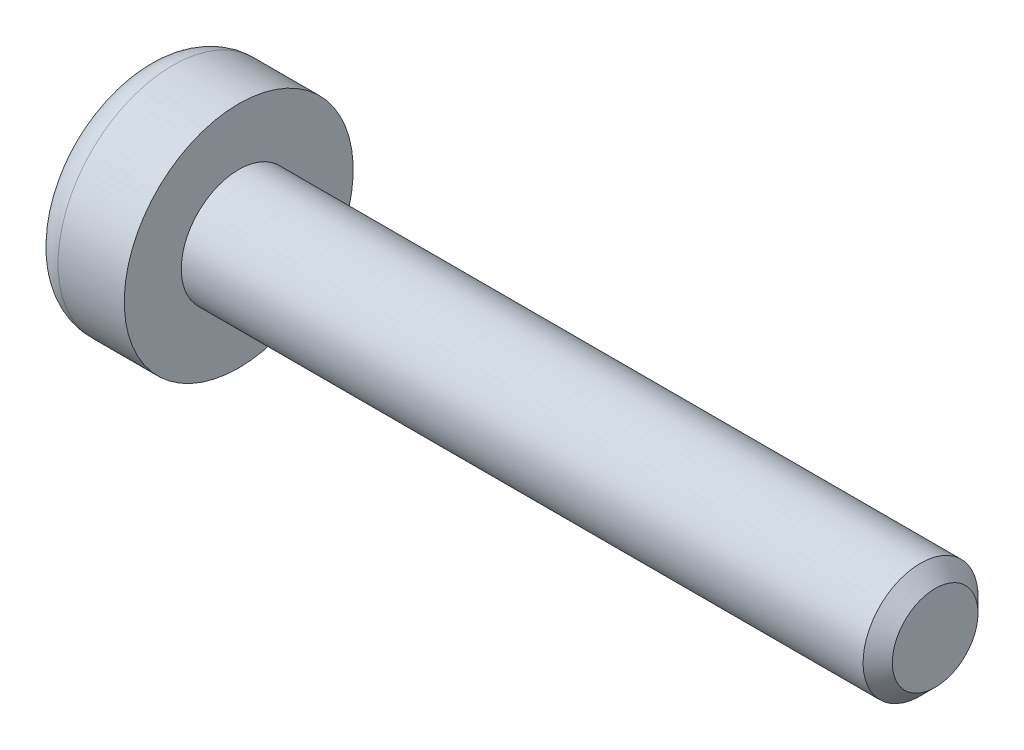
ISO-10303-21;
HEADER;
FILE_DESCRIPTION(('STEP AP214'),'2;1');
FILE_NAME('part.step','',(''),(''),'','','');
FILE_SCHEMA(('AUTOMOTIVE_DESIGN { 1 0 10303 214 1 1 1 1 }'));
ENDSEC;
DATA;
#1=APPLICATION_CONTEXT('core data for automotive mechanical design processes');
#2=APPLICATION_PROTOCOL_DEFINITION('international standard','automotive_design',2000,#1);
#3=PRODUCT_CONTEXT('',#1,'mechanical');
#4=PRODUCT('Part','Part','',(#3));
#5=PRODUCT_RELATED_PRODUCT_CATEGORY('part','',(#4));
#6=PRODUCT_DEFINITION_FORMATION('','',#4);
#7=PRODUCT_DEFINITION_CONTEXT('part definition',#1,'design');
#8=PRODUCT_DEFINITION('design','',#6,#7);
#9=PRODUCT_DEFINITION_SHAPE('','',#8);
#10=(LENGTH_UNIT() NAMED_UNIT(*) SI_UNIT(.MILLI.,.METRE.));
#11=(NAMED_UNIT(*) PLANE_ANGLE_UNIT() SI_UNIT($,.RADIAN.));
#12=(NAMED_UNIT(*) SI_UNIT($,.STERADIAN.) SOLID_ANGLE_UNIT());
#13=UNCERTAINTY_MEASURE_WITH_UNIT(LENGTH_MEASURE(1.E-05),#10,'distance_accuracy_value','');
#14=(GEOMETRIC_REPRESENTATION_CONTEXT(3) GLOBAL_UNCERTAINTY_ASSIGNED_CONTEXT((#13)) GLOBAL_UNIT_ASSIGNED_CONTEXT((#10,
#11,#12)) REPRESENTATION_CONTEXT('',''));
#15=CARTESIAN_POINT('',(0.,0.,0.));
#16=DIRECTION('',(0.,0.,1.));
#17=DIRECTION('',(1.,0.,0.));
#18=AXIS2_PLACEMENT_3D('',#15,#16,#17);
#19=CARTESIAN_POINT('',(0.,0.,0.));
#20=DIRECTION('',(1.,0.,0.));
#21=DIRECTION('',(0.,1.,0.));
#22=AXIS2_PLACEMENT_3D('',#19,#20,#21);
#23=PLANE('',#22);
#24=CARTESIAN_POINT('',(0.,0.,0.));
#25=DIRECTION('',(1.,0.,0.));
#26=DIRECTION('',(0.,1.,0.));
#27=AXIS2_PLACEMENT_3D('',#24,#25,#26);
#28=CIRCLE('',#27,1.1176);
#29=CARTESIAN_POINT('',(0.,1.1176,0.));
#30=VERTEX_POINT('',#29);
#31=EDGE_CURVE('E190',#30,#30,#28,.T.);
#32=ORIENTED_EDGE('',*,*,#31,.T.);
#33=EDGE_LOOP('',(#32));
#34=FACE_BOUND('',#33,.T.);
#35=ADVANCED_FACE('F36',(#34),#23,.T.);
#36=CARTESIAN_POINT('',(0.,0.,0.));
#37=DIRECTION('',(-1.,0.,0.));
#38=DIRECTION('',(0.,-1.,0.));
#39=AXIS2_PLACEMENT_3D('',#36,#37,#38);
#40=CONICAL_SURFACE('',#39,1.1176,0.785398163397448);
#41=CARTESIAN_POINT('',(-0.381,0.,0.));
#42=DIRECTION('',(1.,0.,0.));
#43=DIRECTION('',(0.,1.,0.));
#44=AXIS2_PLACEMENT_3D('',#41,#42,#43);
#45=CIRCLE('',#44,1.4986);
#46=CARTESIAN_POINT('',(-0.381,1.4986,0.));
#47=VERTEX_POINT('',#46);
#48=EDGE_CURVE('E187',#47,#47,#45,.T.);
#49=ORIENTED_EDGE('',*,*,#48,.T.);
#50=EDGE_LOOP('',(#49));
#51=FACE_BOUND('',#50,.T.);
#52=ORIENTED_EDGE('',*,*,#31,.F.);
#53=EDGE_LOOP('',(#52));
#54=FACE_BOUND('',#53,.T.);
#55=ADVANCED_FACE('F210',(#51,#54),#40,.T.);
#56=CARTESIAN_POINT('',(0.,0.,0.));
#57=DIRECTION('',(1.,0.,0.));
#58=DIRECTION('',(0.,1.,0.));
#59=AXIS2_PLACEMENT_3D('',#56,#57,#58);
#60=CYLINDRICAL_SURFACE('',#59,1.4986);
#61=CARTESIAN_POINT('',(-18.161,0.,0.));
#62=DIRECTION('',(1.,0.,0.));
#63=DIRECTION('',(0.,1.,0.));
#64=AXIS2_PLACEMENT_3D('',#61,#62,#63);
#65=CIRCLE('',#64,1.4986);
#66=CARTESIAN_POINT('',(-18.161,1.4986,0.));
#67=VERTEX_POINT('',#66);
#68=EDGE_CURVE('E184',#67,#67,#65,.T.);
#69=ORIENTED_EDGE('',*,*,#68,.T.);
#70=EDGE_LOOP('',(#69));
#71=FACE_BOUND('',#70,.T.);
#72=ORIENTED_EDGE('',*,*,#48,.F.);
#73=EDGE_LOOP('',(#72));
#74=FACE_BOUND('',#73,.T.);
#75=ADVANCED_FACE('F215',(#71,#74),#60,.T.);
#76=CARTESIAN_POINT('',(-18.161,2.9845,0.));
#77=DIRECTION('',(1.,0.,0.));
#78=DIRECTION('',(0.,1.,0.));
#79=AXIS2_PLACEMENT_3D('',#76,#77,#78);
#80=PLANE('',#79);
#81=CARTESIAN_POINT('',(-18.161,0.,0.));
#82=DIRECTION('',(1.,0.,0.));
#83=DIRECTION('',(0.,1.,0.));
#84=AXIS2_PLACEMENT_3D('',#81,#82,#83);
#85=CIRCLE('',#84,2.9845);
#86=CARTESIAN_POINT('',(-18.161,2.9845,0.));
#87=VERTEX_POINT('',#86);
#88=EDGE_CURVE('E181',#87,#87,#85,.T.);
#89=ORIENTED_EDGE('',*,*,#88,.T.);
#90=EDGE_LOOP('',(#89));
#91=FACE_BOUND('',#90,.T.);
#92=ORIENTED_EDGE('',*,*,#68,.F.);
#93=EDGE_LOOP('',(#92));
#94=FACE_BOUND('',#93,.T.);
#95=ADVANCED_FACE('F221',(#91,#94),#80,.T.);
#96=CARTESIAN_POINT('',(0.,0.,0.));
#97=DIRECTION('',(1.,0.,0.));
#98=DIRECTION('',(0.,1.,0.));
#99=AXIS2_PLACEMENT_3D('',#96,#97,#98);
#100=CYLINDRICAL_SURFACE('',#99,2.9845);
#101=CARTESIAN_POINT('',(-19.8882,0.,0.));
#102=DIRECTION('',(-1.,0.,0.));
#103=DIRECTION('',(0.,-1.,0.));
#104=AXIS2_PLACEMENT_3D('',#101,#102,#103);
#105=CIRCLE('',#104,2.9845);
#106=CARTESIAN_POINT('',(-19.8882,-2.9845,0.));
#107=VERTEX_POINT('',#106);
#108=EDGE_CURVE('E44',#107,#107,#105,.F.);
#109=ORIENTED_EDGE('',*,*,#108,.T.);
#110=EDGE_LOOP('',(#109));
#111=FACE_BOUND('',#110,.T.);
#112=ORIENTED_EDGE('',*,*,#88,.F.);
#113=EDGE_LOOP('',(#112));
#114=FACE_BOUND('',#113,.T.);
#115=ADVANCED_FACE('F195',(#111,#114),#100,.T.);
#116=CARTESIAN_POINT('',(-20.6502,0.,0.));
#117=DIRECTION('',(-1.,0.,0.));
#118=DIRECTION('',(0.,-1.,0.));
#119=AXIS2_PLACEMENT_3D('',#116,#117,#118);
#120=PLANE('',#119);
#121=DIRECTION('',(0.,0.,-1.));
#122=VECTOR('',#121,1.);
#123=CARTESIAN_POINT('',(-20.6502,0.380999999999998,-0.381));
#124=LINE('',#123,#122);
#125=CARTESIAN_POINT('',(-20.6502,0.380999999999998,-0.381));
#126=VERTEX_POINT('',#125);
#127=CARTESIAN_POINT('',(-20.6502,0.380999999999997,-1.905));
#128=VERTEX_POINT('',#127);
#129=EDGE_CURVE('E51',#126,#128,#124,.T.);
#130=ORIENTED_EDGE('',*,*,#129,.F.);
#131=DIRECTION('',(0.,-1.,0.));
#132=VECTOR('',#131,1.);
#133=CARTESIAN_POINT('',(-20.6502,1.905,-0.381));
#134=LINE('',#133,#132);
#135=CARTESIAN_POINT('',(-20.6502,1.905,-0.381));
#136=VERTEX_POINT('',#135);
#137=EDGE_CURVE('E149',#136,#126,#134,.T.);
#138=ORIENTED_EDGE('',*,*,#137,.F.);
#139=DIRECTION('',(0.,0.,-1.));
#140=VECTOR('',#139,1.);
#141=CARTESIAN_POINT('',(-20.6502,1.905,0.381));
#142=LINE('',#141,#140);
#143=CARTESIAN_POINT('',(-20.6502,1.905,0.381));
#144=VERTEX_POINT('',#143);
#145=EDGE_CURVE('E146',#144,#136,#142,.T.);
#146=ORIENTED_EDGE('',*,*,#145,.F.);
#147=DIRECTION('',(0.,1.,0.));
#148=VECTOR('',#147,1.);
#149=CARTESIAN_POINT('',(-20.6502,1.905,0.381));
#150=LINE('',#149,#148);
#151=CARTESIAN_POINT('',(-20.6502,0.380999999999998,0.381));
#152=VERTEX_POINT('',#151);
#153=EDGE_CURVE('E143',#152,#144,#150,.T.);
#154=ORIENTED_EDGE('',*,*,#153,.F.);
#155=DIRECTION('',(0.,0.,-1.));
#156=VECTOR('',#155,1.);
#157=CARTESIAN_POINT('',(-20.6502,0.380999999999998,1.905));
#158=LINE('',#157,#156);
#159=CARTESIAN_POINT('',(-20.6502,0.380999999999998,1.905));
#160=VERTEX_POINT('',#159);
#161=EDGE_CURVE('E140',#160,#152,#158,.T.);
#162=ORIENTED_EDGE('',*,*,#161,.F.);
#163=DIRECTION('',(0.,1.,0.));
#164=VECTOR('',#163,1.);
#165=CARTESIAN_POINT('',(-20.6502,-0.381000000000002,1.905));
#166=LINE('',#165,#164);
#167=CARTESIAN_POINT('',(-20.6502,-0.381000000000002,1.905));
#168=VERTEX_POINT('',#167);
#169=EDGE_CURVE('E137',#168,#160,#166,.T.);
#170=ORIENTED_EDGE('',*,*,#169,.F.);
#171=DIRECTION('',(0.,0.,1.));
#172=VECTOR('',#171,1.);
#173=CARTESIAN_POINT('',(-20.6502,-0.381000000000002,1.905));
#174=LINE('',#173,#172);
#175=CARTESIAN_POINT('',(-20.6502,-0.381000000000002,0.381));
#176=VERTEX_POINT('',#175);
#177=EDGE_CURVE('E134',#176,#168,#174,.T.);
#178=ORIENTED_EDGE('',*,*,#177,.F.);
#179=DIRECTION('',(0.,1.,0.));
#180=VECTOR('',#179,1.);
#181=CARTESIAN_POINT('',(-20.6502,-0.381000000000002,0.381));
#182=LINE('',#181,#180);
#183=CARTESIAN_POINT('',(-20.6502,-1.905,0.381));
#184=VERTEX_POINT('',#183);
#185=EDGE_CURVE('E131',#184,#176,#182,.T.);
#186=ORIENTED_EDGE('',*,*,#185,.F.);
#187=DIRECTION('',(0.,0.,1.));
#188=VECTOR('',#187,1.);
#189=CARTESIAN_POINT('',(-20.6502,-1.905,0.381));
#190=LINE('',#189,#188);
#191=CARTESIAN_POINT('',(-20.6502,-1.905,-0.381));
#192=VERTEX_POINT('',#191);
#193=EDGE_CURVE('E125',#192,#184,#190,.T.);
#194=ORIENTED_EDGE('',*,*,#193,.F.);
#195=DIRECTION('',(0.,-1.,0.));
#196=VECTOR('',#195,1.);
#197=CARTESIAN_POINT('',(-20.6502,-0.381000000000003,-0.381));
#198=LINE('',#197,#196);
#199=CARTESIAN_POINT('',(-20.6502,-0.381000000000003,-0.381));
#200=VERTEX_POINT('',#199);
#201=EDGE_CURVE('E123',#200,#192,#198,.T.);
#202=ORIENTED_EDGE('',*,*,#201,.F.);
#203=DIRECTION('',(0.,0.,1.));
#204=VECTOR('',#203,1.);
#205=CARTESIAN_POINT('',(-20.6502,-0.381000000000003,-0.381));
#206=LINE('',#205,#204);
#207=CARTESIAN_POINT('',(-20.6502,-0.381000000000003,-1.905));
#208=VERTEX_POINT('',#207);
#209=EDGE_CURVE('E108',#208,#200,#206,.T.);
#210=ORIENTED_EDGE('',*,*,#209,.F.);
#211=DIRECTION('',(0.,-1.,0.));
#212=VECTOR('',#211,1.);
#213=CARTESIAN_POINT('',(-20.6502,-0.381000000000003,-1.905));
#214=LINE('',#213,#212);
#215=EDGE_CURVE('E115',#128,#208,#214,.T.);
#216=ORIENTED_EDGE('',*,*,#215,.F.);
#217=EDGE_LOOP('',(#130,#138,#146,#154,#162,#170,#178,#186,#194,#202,#210,#216));
#218=FACE_BOUND('',#217,.T.);
#219=CARTESIAN_POINT('',(-20.6502,0.,0.));
#220=DIRECTION('',(-1.,0.,0.));
#221=DIRECTION('',(0.,-1.,0.));
#222=AXIS2_PLACEMENT_3D('',#219,#220,#221);
#223=CIRCLE('',#222,2.2225);
#224=CARTESIAN_POINT('',(-20.6502,-2.2225,0.));
#225=VERTEX_POINT('',#224);
#226=EDGE_CURVE('E11',#225,#225,#223,.T.);
#227=ORIENTED_EDGE('',*,*,#226,.T.);
#228=EDGE_LOOP('',(#227));
#229=FACE_BOUND('',#228,.T.);
#230=ADVANCED_FACE('F119',(#218,#229),#120,.T.);
#231=CARTESIAN_POINT('',(-19.8882,0.,0.));
#232=DIRECTION('',(-1.,0.,0.));
#233=DIRECTION('',(0.,-1.,0.));
#234=AXIS2_PLACEMENT_3D('',#231,#232,#233);
#235=TOROIDAL_SURFACE('',#234,2.2225,0.762);
#236=ORIENTED_EDGE('',*,*,#226,.F.);
#237=EDGE_LOOP('',(#236));
#238=FACE_BOUND('',#237,.T.);
#239=ORIENTED_EDGE('',*,*,#108,.F.);
#240=EDGE_LOOP('',(#239));
#241=FACE_BOUND('',#240,.T.);
#242=ADVANCED_FACE('F38',(#238,#241),#235,.T.);
#243=CARTESIAN_POINT('',(-20.6502,0.380999999999998,-0.381));
#244=DIRECTION('',(0.707106781186549,0.707106781186546,0.));
#245=DIRECTION('',(-0.707106781186546,0.707106781186549,0.));
#246=AXIS2_PLACEMENT_3D('',#243,#244,#245);
#247=PLANE('',#246);
#248=DIRECTION('',(0.,0.,1.));
#249=VECTOR('',#248,1.);
#250=CARTESIAN_POINT('',(-20.2692,0.,-0.381));
#251=LINE('',#250,#249);
#252=CARTESIAN_POINT('',(-20.2692,0.,-1.524));
#253=VERTEX_POINT('',#252);
#254=CARTESIAN_POINT('',(-20.2692,0.,0.));
#255=VERTEX_POINT('',#254);
#256=EDGE_CURVE('E56',#253,#255,#251,.T.);
#257=ORIENTED_EDGE('',*,*,#256,.T.);
#258=DIRECTION('',(-0.577350269189624,0.577350269189626,-0.577350269189627));
#259=VECTOR('',#258,1.);
#260=CARTESIAN_POINT('',(-20.6502,0.380999999999998,-0.381));
#261=LINE('',#260,#259);
#262=EDGE_CURVE('E152',#255,#126,#261,.T.);
#263=ORIENTED_EDGE('',*,*,#262,.T.);
#264=ORIENTED_EDGE('',*,*,#129,.T.);
#265=DIRECTION('',(-0.577350269189625,0.577350269189626,-0.577350269189627));
#266=VECTOR('',#265,1.);
#267=CARTESIAN_POINT('',(-20.1422,-0.127000000000004,-1.397));
#268=LINE('',#267,#266);
#269=EDGE_CURVE('E112',#253,#128,#268,.T.);
#270=ORIENTED_EDGE('',*,*,#269,.F.);
#271=EDGE_LOOP('',(#257,#263,#264,#270));
#272=FACE_BOUND('',#271,.T.);
#273=ADVANCED_FACE('F199',(#272),#247,.F.);
#274=CARTESIAN_POINT('',(-20.6502,1.905,-0.381));
#275=DIRECTION('',(0.707106781186549,0.,-0.707106781186546));
#276=DIRECTION('',(-0.707106781186546,0.,-0.707106781186549));
#277=AXIS2_PLACEMENT_3D('',#274,#275,#276);
#278=PLANE('',#277);
#279=DIRECTION('',(-0.577350269189624,0.577350269189626,-0.577350269189627));
#280=VECTOR('',#279,1.);
#281=CARTESIAN_POINT('',(-20.3962,1.651,-0.126999999999999));
#282=LINE('',#281,#280);
#283=CARTESIAN_POINT('',(-20.2692,1.524,0.));
#284=VERTEX_POINT('',#283);
#285=EDGE_CURVE('E155',#284,#136,#282,.T.);
#286=ORIENTED_EDGE('',*,*,#285,.T.);
#287=ORIENTED_EDGE('',*,*,#137,.T.);
#288=ORIENTED_EDGE('',*,*,#262,.F.);
#289=DIRECTION('',(0.,-1.,0.));
#290=VECTOR('',#289,1.);
#291=CARTESIAN_POINT('',(-20.2692,1.905,0.));
#292=LINE('',#291,#290);
#293=EDGE_CURVE('E154',#284,#255,#292,.T.);
#294=ORIENTED_EDGE('',*,*,#293,.F.);
#295=EDGE_LOOP('',(#286,#287,#288,#294));
#296=FACE_BOUND('',#295,.T.);
#297=ADVANCED_FACE('F205',(#296),#278,.F.);
#298=CARTESIAN_POINT('',(-20.6502,1.905,0.381));
#299=DIRECTION('',(0.707106781186549,0.707106781186546,0.));
#300=DIRECTION('',(-0.707106781186546,0.707106781186549,0.));
#301=AXIS2_PLACEMENT_3D('',#298,#299,#300);
#302=PLANE('',#301);
#303=ORIENTED_EDGE('',*,*,#145,.T.);
#304=ORIENTED_EDGE('',*,*,#285,.F.);
#305=DIRECTION('',(-0.577350269189624,0.577350269189626,0.577350269189626));
#306=VECTOR('',#305,1.);
#307=CARTESIAN_POINT('',(-20.6502,1.905,0.381));
#308=LINE('',#307,#306);
#309=EDGE_CURVE('E170',#284,#144,#308,.T.);
#310=ORIENTED_EDGE('',*,*,#309,.T.);
#311=EDGE_LOOP('',(#303,#304,#310));
#312=FACE_BOUND('',#311,.T.);
#313=ADVANCED_FACE('F230',(#312),#302,.F.);
#314=CARTESIAN_POINT('',(-20.6502,1.905,0.381));
#315=DIRECTION('',(0.707106781186549,0.,0.707106781186546));
#316=DIRECTION('',(0.707106781186546,0.,-0.707106781186549));
#317=AXIS2_PLACEMENT_3D('',#314,#315,#316);
#318=PLANE('',#317);
#319=ORIENTED_EDGE('',*,*,#293,.T.);
#320=DIRECTION('',(-0.577350269189625,0.577350269189627,0.577350269189627));
#321=VECTOR('',#320,1.);
#322=CARTESIAN_POINT('',(-21.1582,0.888999999999999,0.889000000000001));
#323=LINE('',#322,#321);
#324=EDGE_CURVE('E168',#255,#152,#323,.T.);
#325=ORIENTED_EDGE('',*,*,#324,.T.);
#326=ORIENTED_EDGE('',*,*,#153,.T.);
#327=ORIENTED_EDGE('',*,*,#309,.F.);
#328=EDGE_LOOP('',(#319,#325,#326,#327));
#329=FACE_BOUND('',#328,.T.);
#330=ADVANCED_FACE('F234',(#329),#318,.F.);
#331=CARTESIAN_POINT('',(-20.6502,0.380999999999998,1.905));
#332=DIRECTION('',(0.707106781186549,0.707106781186546,0.));
#333=DIRECTION('',(-0.707106781186546,0.707106781186549,0.));
#334=AXIS2_PLACEMENT_3D('',#331,#332,#333);
#335=PLANE('',#334);
#336=DIRECTION('',(-0.577350269189624,0.577350269189626,0.577350269189627));
#337=VECTOR('',#336,1.);
#338=CARTESIAN_POINT('',(-20.3962,0.126999999999997,1.651));
#339=LINE('',#338,#337);
#340=CARTESIAN_POINT('',(-20.2692,0.,1.524));
#341=VERTEX_POINT('',#340);
#342=EDGE_CURVE('E166',#341,#160,#339,.T.);
#343=ORIENTED_EDGE('',*,*,#342,.T.);
#344=ORIENTED_EDGE('',*,*,#161,.T.);
#345=ORIENTED_EDGE('',*,*,#324,.F.);
#346=DIRECTION('',(0.,0.,-1.));
#347=VECTOR('',#346,1.);
#348=CARTESIAN_POINT('',(-20.2692,0.,1.905));
#349=LINE('',#348,#347);
#350=EDGE_CURVE('E175',#341,#255,#349,.T.);
#351=ORIENTED_EDGE('',*,*,#350,.F.);
#352=EDGE_LOOP('',(#343,#344,#345,#351));
#353=FACE_BOUND('',#352,.T.);
#354=ADVANCED_FACE('F238',(#353),#335,.F.);
#355=CARTESIAN_POINT('',(-20.6502,-0.381000000000002,1.905));
#356=DIRECTION('',(0.707106781186549,0.,0.707106781186546));
#357=DIRECTION('',(0.707106781186546,0.,-0.707106781186549));
#358=AXIS2_PLACEMENT_3D('',#355,#356,#357);
#359=PLANE('',#358);
#360=ORIENTED_EDGE('',*,*,#169,.T.);
#361=ORIENTED_EDGE('',*,*,#342,.F.);
#362=DIRECTION('',(-0.577350269189624,-0.577350269189627,0.577350269189626));
#363=VECTOR('',#362,1.);
#364=CARTESIAN_POINT('',(-20.6502,-0.381000000000002,1.905));
#365=LINE('',#364,#363);
#366=EDGE_CURVE('E164',#341,#168,#365,.T.);
#367=ORIENTED_EDGE('',*,*,#366,.T.);
#368=EDGE_LOOP('',(#360,#361,#367));
#369=FACE_BOUND('',#368,.T.);
#370=ADVANCED_FACE('F242',(#369),#359,.F.);
#371=CARTESIAN_POINT('',(-20.6502,-0.381000000000002,1.905));
#372=DIRECTION('',(0.707106781186549,-0.707106781186546,0.));
#373=DIRECTION('',(0.707106781186546,0.707106781186549,0.));
#374=AXIS2_PLACEMENT_3D('',#371,#372,#373);
#375=PLANE('',#374);
#376=ORIENTED_EDGE('',*,*,#350,.T.);
#377=DIRECTION('',(-0.577350269189624,-0.577350269189627,0.577350269189627));
#378=VECTOR('',#377,1.);
#379=CARTESIAN_POINT('',(-21.1582,-0.889000000000003,0.889000000000002));
#380=LINE('',#379,#378);
#381=EDGE_CURVE('E162',#255,#176,#380,.T.);
#382=ORIENTED_EDGE('',*,*,#381,.T.);
#383=ORIENTED_EDGE('',*,*,#177,.T.);
#384=ORIENTED_EDGE('',*,*,#366,.F.);
#385=EDGE_LOOP('',(#376,#382,#383,#384));
#386=FACE_BOUND('',#385,.T.);
#387=ADVANCED_FACE('F246',(#386),#375,.F.);
#388=CARTESIAN_POINT('',(-20.6502,-0.381000000000002,0.381));
#389=DIRECTION('',(0.707106781186549,0.,0.707106781186546));
#390=DIRECTION('',(0.707106781186546,0.,-0.707106781186549));
#391=AXIS2_PLACEMENT_3D('',#388,#389,#390);
#392=PLANE('',#391);
#393=DIRECTION('',(-0.577350269189624,-0.577350269189627,0.577350269189626));
#394=VECTOR('',#393,1.);
#395=CARTESIAN_POINT('',(-20.6502,-1.905,0.381));
#396=LINE('',#395,#394);
#397=CARTESIAN_POINT('',(-20.2692,-1.524,0.));
#398=VERTEX_POINT('',#397);
#399=EDGE_CURVE('E160',#398,#184,#396,.T.);
#400=ORIENTED_EDGE('',*,*,#399,.T.);
#401=ORIENTED_EDGE('',*,*,#185,.T.);
#402=ORIENTED_EDGE('',*,*,#381,.F.);
#403=DIRECTION('',(0.,1.,0.));
#404=VECTOR('',#403,1.);
#405=CARTESIAN_POINT('',(-20.2692,-0.381000000000002,0.));
#406=LINE('',#405,#404);
#407=EDGE_CURVE('E178',#398,#255,#406,.T.);
#408=ORIENTED_EDGE('',*,*,#407,.F.);
#409=EDGE_LOOP('',(#400,#401,#402,#408));
#410=FACE_BOUND('',#409,.T.);
#411=ADVANCED_FACE('F250',(#410),#392,.F.);
#412=CARTESIAN_POINT('',(-20.6502,-1.905,0.381));
#413=DIRECTION('',(0.707106781186549,-0.707106781186546,0.));
#414=DIRECTION('',(0.707106781186546,0.707106781186549,0.));
#415=AXIS2_PLACEMENT_3D('',#412,#413,#414);
#416=PLANE('',#415);
#417=ORIENTED_EDGE('',*,*,#193,.T.);
#418=ORIENTED_EDGE('',*,*,#399,.F.);
#419=DIRECTION('',(-0.577350269189624,-0.577350269189627,-0.577350269189627));
#420=VECTOR('',#419,1.);
#421=CARTESIAN_POINT('',(-20.1422,-1.397,0.127000000000001));
#422=LINE('',#421,#420);
#423=EDGE_CURVE('E158',#398,#192,#422,.T.);
#424=ORIENTED_EDGE('',*,*,#423,.T.);
#425=EDGE_LOOP('',(#417,#418,#424));
#426=FACE_BOUND('',#425,.T.);
#427=ADVANCED_FACE('F254',(#426),#416,.F.);
#428=CARTESIAN_POINT('',(-20.6502,-0.381000000000003,-0.381));
#429=DIRECTION('',(0.707106781186549,0.,-0.707106781186546));
#430=DIRECTION('',(-0.707106781186546,0.,-0.707106781186549));
#431=AXIS2_PLACEMENT_3D('',#428,#429,#430);
#432=PLANE('',#431);
#433=ORIENTED_EDGE('',*,*,#407,.T.);
#434=DIRECTION('',(-0.577350269189624,-0.577350269189627,-0.577350269189627));
#435=VECTOR('',#434,1.);
#436=CARTESIAN_POINT('',(-20.6502,-0.381000000000003,-0.381));
#437=LINE('',#436,#435);
#438=EDGE_CURVE('E111',#255,#200,#437,.T.);
#439=ORIENTED_EDGE('',*,*,#438,.T.);
#440=ORIENTED_EDGE('',*,*,#201,.T.);
#441=ORIENTED_EDGE('',*,*,#423,.F.);
#442=EDGE_LOOP('',(#433,#439,#440,#441));
#443=FACE_BOUND('',#442,.T.);
#444=ADVANCED_FACE('F258',(#443),#432,.F.);
#445=CARTESIAN_POINT('',(-20.6502,-0.381000000000003,-0.381));
#446=DIRECTION('',(0.707106781186549,-0.707106781186546,0.));
#447=DIRECTION('',(0.707106781186546,0.707106781186549,0.));
#448=AXIS2_PLACEMENT_3D('',#445,#446,#447);
#449=PLANE('',#448);
#450=DIRECTION('',(-0.577350269189624,-0.577350269189627,-0.577350269189626));
#451=VECTOR('',#450,1.);
#452=CARTESIAN_POINT('',(-20.6502,-0.381000000000003,-1.905));
#453=LINE('',#452,#451);
#454=EDGE_CURVE('E103',#253,#208,#453,.T.);
#455=ORIENTED_EDGE('',*,*,#454,.T.);
#456=ORIENTED_EDGE('',*,*,#209,.T.);
#457=ORIENTED_EDGE('',*,*,#438,.F.);
#458=ORIENTED_EDGE('',*,*,#256,.F.);
#459=EDGE_LOOP('',(#455,#456,#457,#458));
#460=FACE_BOUND('',#459,.T.);
#461=ADVANCED_FACE('F105',(#460),#449,.F.);
#462=CARTESIAN_POINT('',(-20.6502,-0.381000000000003,-1.905));
#463=DIRECTION('',(0.707106781186549,0.,-0.707106781186546));
#464=DIRECTION('',(-0.707106781186546,0.,-0.707106781186549));
#465=AXIS2_PLACEMENT_3D('',#462,#463,#464);
#466=PLANE('',#465);
#467=ORIENTED_EDGE('',*,*,#215,.T.);
#468=ORIENTED_EDGE('',*,*,#454,.F.);
#469=ORIENTED_EDGE('',*,*,#269,.T.);
#470=EDGE_LOOP('',(#467,#468,#469));
#471=FACE_BOUND('',#470,.T.);
#472=ADVANCED_FACE('F116',(#471),#466,.F.);
#473=CLOSED_SHELL('',(#35,#55,#75,#95,#115,#230,#242,#273,#297,#313,#330,#354,#370,#387,#411,
#427,#444,#461,#472));
#474=MANIFOLD_SOLID_BREP('B2',#473);
#475=ADVANCED_BREP_SHAPE_REPRESENTATION('',(#18,#474),#14);
#476=SHAPE_DEFINITION_REPRESENTATION(#9,#475);
ENDSEC;
END-ISO-10303-21;
